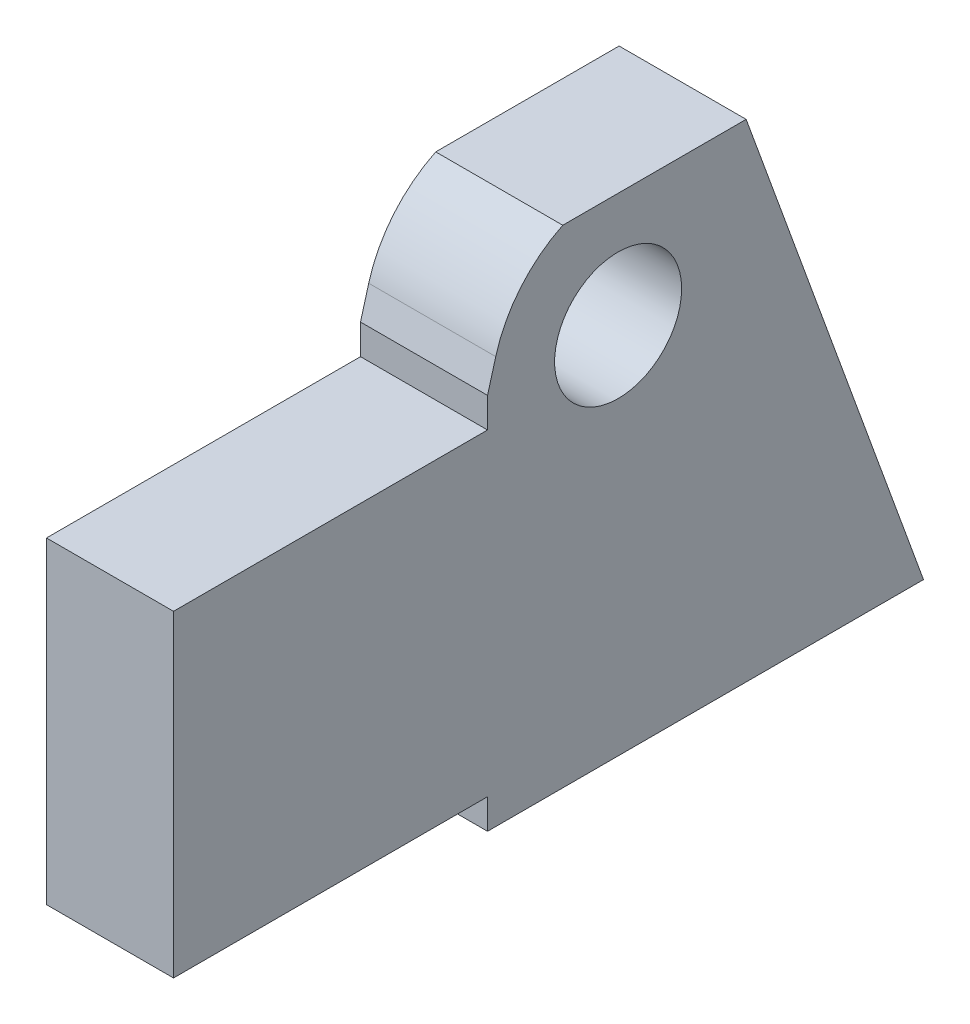
ISO-10303-21;
HEADER;
FILE_DESCRIPTION(('STEP AP214'),'2;1');
FILE_NAME('part.step','',(''),(''),'','','');
FILE_SCHEMA(('AUTOMOTIVE_DESIGN { 1 0 10303 214 1 1 1 1 }'));
ENDSEC;
DATA;
#1=APPLICATION_CONTEXT('core data for automotive mechanical design processes');
#2=APPLICATION_PROTOCOL_DEFINITION('international standard','automotive_design',2000,#1);
#3=PRODUCT_CONTEXT('',#1,'mechanical');
#4=PRODUCT('Part','Part','',(#3));
#5=PRODUCT_RELATED_PRODUCT_CATEGORY('part','',(#4));
#6=PRODUCT_DEFINITION_FORMATION('','',#4);
#7=PRODUCT_DEFINITION_CONTEXT('part definition',#1,'design');
#8=PRODUCT_DEFINITION('design','',#6,#7);
#9=PRODUCT_DEFINITION_SHAPE('','',#8);
#10=(LENGTH_UNIT() NAMED_UNIT(*) SI_UNIT(.MILLI.,.METRE.));
#11=(NAMED_UNIT(*) PLANE_ANGLE_UNIT() SI_UNIT($,.RADIAN.));
#12=(NAMED_UNIT(*) SI_UNIT($,.STERADIAN.) SOLID_ANGLE_UNIT());
#13=UNCERTAINTY_MEASURE_WITH_UNIT(LENGTH_MEASURE(1.E-05),#10,'distance_accuracy_value','');
#14=(GEOMETRIC_REPRESENTATION_CONTEXT(3) GLOBAL_UNCERTAINTY_ASSIGNED_CONTEXT((#13)) GLOBAL_UNIT_ASSIGNED_CONTEXT((#10,
#11,#12)) REPRESENTATION_CONTEXT('',''));
#15=CARTESIAN_POINT('',(0.,0.,0.));
#16=DIRECTION('',(0.,0.,1.));
#17=DIRECTION('',(1.,0.,0.));
#18=AXIS2_PLACEMENT_3D('',#15,#16,#17);
#19=CARTESIAN_POINT('',(6.35,-2.99720000000001,-31.3944));
#20=DIRECTION('',(0.,1.,0.));
#21=DIRECTION('',(0.,0.,1.));
#22=AXIS2_PLACEMENT_3D('',#19,#20,#21);
#23=PLANE('',#22);
#24=DIRECTION('',(0.,0.,-1.));
#25=VECTOR('',#24,1.);
#26=CARTESIAN_POINT('',(-6.35,-2.99720000000001,-31.3944));
#27=LINE('',#26,#25);
#28=CARTESIAN_POINT('',(-6.35,-2.99720000000001,-31.3944));
#29=VERTEX_POINT('',#28);
#30=CARTESIAN_POINT('',(-6.35,-2.9972,-74.9808));
#31=VERTEX_POINT('',#30);
#32=EDGE_CURVE('E140',#29,#31,#27,.T.);
#33=ORIENTED_EDGE('',*,*,#32,.T.);
#34=DIRECTION('',(-1.,0.,0.));
#35=VECTOR('',#34,1.);
#36=CARTESIAN_POINT('',(6.35,-2.9972,-74.9808));
#37=LINE('',#36,#35);
#38=CARTESIAN_POINT('',(6.35,-2.9972,-74.9808));
#39=VERTEX_POINT('',#38);
#40=EDGE_CURVE('E11',#39,#31,#37,.T.);
#41=ORIENTED_EDGE('',*,*,#40,.F.);
#42=DIRECTION('',(0.,0.,-1.));
#43=VECTOR('',#42,1.);
#44=CARTESIAN_POINT('',(6.35,-2.99720000000001,-31.3944));
#45=LINE('',#44,#43);
#46=CARTESIAN_POINT('',(6.35,-2.99720000000001,-31.3944));
#47=VERTEX_POINT('',#46);
#48=EDGE_CURVE('E161',#47,#39,#45,.T.);
#49=ORIENTED_EDGE('',*,*,#48,.F.);
#50=DIRECTION('',(-1.,0.,0.));
#51=VECTOR('',#50,1.);
#52=CARTESIAN_POINT('',(6.35,-2.99720000000001,-31.3944));
#53=LINE('',#52,#51);
#54=EDGE_CURVE('E136',#47,#29,#53,.T.);
#55=ORIENTED_EDGE('',*,*,#54,.T.);
#56=EDGE_LOOP('',(#33,#41,#49,#55));
#57=FACE_BOUND('',#56,.T.);
#58=ADVANCED_FACE('F39',(#57),#23,.F.);
#59=CARTESIAN_POINT('',(6.35,34.7472,-61.2429618897629));
#60=DIRECTION('',(0.,-0.342020143325666,0.939692620785909));
#61=DIRECTION('',(0.,-0.939692620785909,-0.342020143325666));
#62=AXIS2_PLACEMENT_3D('',#59,#60,#61);
#63=PLANE('',#62);
#64=DIRECTION('',(0.,0.939692620785909,0.342020143325666));
#65=VECTOR('',#64,1.);
#66=CARTESIAN_POINT('',(-6.35,34.7472,-61.2429618897629));
#67=LINE('',#66,#65);
#68=CARTESIAN_POINT('',(-6.35,45.72,-57.2491893032067));
#69=VERTEX_POINT('',#68);
#70=EDGE_CURVE('E144',#31,#69,#67,.T.);
#71=ORIENTED_EDGE('',*,*,#70,.T.);
#72=DIRECTION('',(1.,0.,0.));
#73=VECTOR('',#72,1.);
#74=CARTESIAN_POINT('',(-6.35,45.72,-57.2491893032067));
#75=LINE('',#74,#73);
#76=CARTESIAN_POINT('',(6.35,45.72,-57.2491893032067));
#77=VERTEX_POINT('',#76);
#78=EDGE_CURVE('E192',#69,#77,#75,.T.);
#79=ORIENTED_EDGE('',*,*,#78,.T.);
#80=DIRECTION('',(0.,0.939692620785909,0.342020143325666));
#81=VECTOR('',#80,1.);
#82=CARTESIAN_POINT('',(6.35,34.7472,-61.2429618897629));
#83=LINE('',#82,#81);
#84=EDGE_CURVE('E97',#39,#77,#83,.T.);
#85=ORIENTED_EDGE('',*,*,#84,.F.);
#86=ORIENTED_EDGE('',*,*,#40,.T.);
#87=EDGE_LOOP('',(#71,#79,#85,#86));
#88=FACE_BOUND('',#87,.T.);
#89=ADVANCED_FACE('F245',(#88),#63,.F.);
#90=CARTESIAN_POINT('',(6.35,31.75,-31.3944));
#91=DIRECTION('',(0.,0.,-1.));
#92=DIRECTION('',(-1.,0.,0.));
#93=AXIS2_PLACEMENT_3D('',#90,#91,#92);
#94=PLANE('',#93);
#95=DIRECTION('',(0.,-1.,0.));
#96=VECTOR('',#95,1.);
#97=CARTESIAN_POINT('',(-6.35,31.75,-31.3944));
#98=LINE('',#97,#96);
#99=CARTESIAN_POINT('',(-6.35,34.7472,-31.3944));
#100=VERTEX_POINT('',#99);
#101=CARTESIAN_POINT('',(-6.35,31.75,-31.3944));
#102=VERTEX_POINT('',#101);
#103=EDGE_CURVE('E149',#100,#102,#98,.T.);
#104=ORIENTED_EDGE('',*,*,#103,.T.);
#105=DIRECTION('',(-1.,0.,0.));
#106=VECTOR('',#105,1.);
#107=CARTESIAN_POINT('',(6.35,31.75,-31.3944));
#108=LINE('',#107,#106);
#109=CARTESIAN_POINT('',(6.35,31.75,-31.3944));
#110=VERTEX_POINT('',#109);
#111=EDGE_CURVE('E168',#110,#102,#108,.T.);
#112=ORIENTED_EDGE('',*,*,#111,.F.);
#113=DIRECTION('',(0.,-1.,0.));
#114=VECTOR('',#113,1.);
#115=CARTESIAN_POINT('',(6.35,31.75,-31.3944));
#116=LINE('',#115,#114);
#117=CARTESIAN_POINT('',(6.35,34.7472,-31.3944));
#118=VERTEX_POINT('',#117);
#119=EDGE_CURVE('E177',#118,#110,#116,.T.);
#120=ORIENTED_EDGE('',*,*,#119,.F.);
#121=DIRECTION('',(-1.,0.,0.));
#122=VECTOR('',#121,1.);
#123=CARTESIAN_POINT('',(6.35,34.7472,-31.3944));
#124=LINE('',#123,#122);
#125=EDGE_CURVE('E48',#118,#100,#124,.T.);
#126=ORIENTED_EDGE('',*,*,#125,.T.);
#127=EDGE_LOOP('',(#104,#112,#120,#126));
#128=FACE_BOUND('',#127,.T.);
#129=ADVANCED_FACE('F175',(#128),#94,.F.);
#130=CARTESIAN_POINT('',(6.35,31.75,0.));
#131=DIRECTION('',(0.,-1.,0.));
#132=DIRECTION('',(0.,0.,-1.));
#133=AXIS2_PLACEMENT_3D('',#130,#131,#132);
#134=PLANE('',#133);
#135=DIRECTION('',(0.,0.,1.));
#136=VECTOR('',#135,1.);
#137=CARTESIAN_POINT('',(-6.35,31.75,0.));
#138=LINE('',#137,#136);
#139=CARTESIAN_POINT('',(-6.35,31.75,0.));
#140=VERTEX_POINT('',#139);
#141=EDGE_CURVE('E152',#102,#140,#138,.T.);
#142=ORIENTED_EDGE('',*,*,#141,.T.);
#143=DIRECTION('',(-1.,0.,0.));
#144=VECTOR('',#143,1.);
#145=CARTESIAN_POINT('',(6.35,31.75,0.));
#146=LINE('',#145,#144);
#147=CARTESIAN_POINT('',(6.35,31.75,0.));
#148=VERTEX_POINT('',#147);
#149=EDGE_CURVE('E129',#148,#140,#146,.T.);
#150=ORIENTED_EDGE('',*,*,#149,.F.);
#151=DIRECTION('',(0.,0.,1.));
#152=VECTOR('',#151,1.);
#153=CARTESIAN_POINT('',(6.35,31.75,0.));
#154=LINE('',#153,#152);
#155=EDGE_CURVE('E118',#110,#148,#154,.T.);
#156=ORIENTED_EDGE('',*,*,#155,.F.);
#157=ORIENTED_EDGE('',*,*,#111,.T.);
#158=EDGE_LOOP('',(#142,#150,#156,#157));
#159=FACE_BOUND('',#158,.T.);
#160=ADVANCED_FACE('F227',(#159),#134,.F.);
#161=CARTESIAN_POINT('',(6.35,31.75,0.));
#162=DIRECTION('',(0.,0.,-1.));
#163=DIRECTION('',(0.,1.,0.));
#164=AXIS2_PLACEMENT_3D('',#161,#162,#163);
#165=PLANE('',#164);
#166=DIRECTION('',(0.,-1.,0.));
#167=VECTOR('',#166,1.);
#168=CARTESIAN_POINT('',(-6.35,31.75,0.));
#169=LINE('',#168,#167);
#170=CARTESIAN_POINT('',(-6.35,0.,0.));
#171=VERTEX_POINT('',#170);
#172=EDGE_CURVE('E127',#140,#171,#169,.T.);
#173=ORIENTED_EDGE('',*,*,#172,.T.);
#174=DIRECTION('',(-1.,0.,0.));
#175=VECTOR('',#174,1.);
#176=CARTESIAN_POINT('',(6.35,0.,0.));
#177=LINE('',#176,#175);
#178=CARTESIAN_POINT('',(6.35,0.,0.));
#179=VERTEX_POINT('',#178);
#180=EDGE_CURVE('E124',#179,#171,#177,.T.);
#181=ORIENTED_EDGE('',*,*,#180,.F.);
#182=DIRECTION('',(0.,-1.,0.));
#183=VECTOR('',#182,1.);
#184=CARTESIAN_POINT('',(6.35,31.75,0.));
#185=LINE('',#184,#183);
#186=EDGE_CURVE('E111',#148,#179,#185,.T.);
#187=ORIENTED_EDGE('',*,*,#186,.F.);
#188=ORIENTED_EDGE('',*,*,#149,.T.);
#189=EDGE_LOOP('',(#173,#181,#187,#188));
#190=FACE_BOUND('',#189,.T.);
#191=ADVANCED_FACE('F125',(#190),#165,.F.);
#192=CARTESIAN_POINT('',(6.35,0.,-31.3944));
#193=DIRECTION('',(0.,1.,0.));
#194=DIRECTION('',(0.,0.,1.));
#195=AXIS2_PLACEMENT_3D('',#192,#193,#194);
#196=PLANE('',#195);
#197=DIRECTION('',(0.,0.,-1.));
#198=VECTOR('',#197,1.);
#199=CARTESIAN_POINT('',(-6.35,0.,-31.3944));
#200=LINE('',#199,#198);
#201=CARTESIAN_POINT('',(-6.35,0.,-31.3944));
#202=VERTEX_POINT('',#201);
#203=EDGE_CURVE('E83',#171,#202,#200,.T.);
#204=ORIENTED_EDGE('',*,*,#203,.T.);
#205=DIRECTION('',(-1.,0.,0.));
#206=VECTOR('',#205,1.);
#207=CARTESIAN_POINT('',(6.35,0.,-31.3944));
#208=LINE('',#207,#206);
#209=CARTESIAN_POINT('',(6.35,0.,-31.3944));
#210=VERTEX_POINT('',#209);
#211=EDGE_CURVE('E130',#210,#202,#208,.T.);
#212=ORIENTED_EDGE('',*,*,#211,.F.);
#213=DIRECTION('',(0.,0.,-1.));
#214=VECTOR('',#213,1.);
#215=CARTESIAN_POINT('',(6.35,0.,-31.3944));
#216=LINE('',#215,#214);
#217=EDGE_CURVE('E116',#179,#210,#216,.T.);
#218=ORIENTED_EDGE('',*,*,#217,.F.);
#219=ORIENTED_EDGE('',*,*,#180,.T.);
#220=EDGE_LOOP('',(#204,#212,#218,#219));
#221=FACE_BOUND('',#220,.T.);
#222=ADVANCED_FACE('F132',(#221),#196,.F.);
#223=CARTESIAN_POINT('',(6.35,0.,-31.3944));
#224=DIRECTION('',(0.,0.,-1.));
#225=DIRECTION('',(-1.,0.,0.));
#226=AXIS2_PLACEMENT_3D('',#223,#224,#225);
#227=PLANE('',#226);
#228=DIRECTION('',(0.,-1.,0.));
#229=VECTOR('',#228,1.);
#230=CARTESIAN_POINT('',(-6.35,0.,-31.3944));
#231=LINE('',#230,#229);
#232=EDGE_CURVE('E89',#202,#29,#231,.T.);
#233=ORIENTED_EDGE('',*,*,#232,.T.);
#234=ORIENTED_EDGE('',*,*,#54,.F.);
#235=DIRECTION('',(0.,-1.,0.));
#236=VECTOR('',#235,1.);
#237=CARTESIAN_POINT('',(6.35,0.,-31.3944));
#238=LINE('',#237,#236);
#239=EDGE_CURVE('E56',#210,#47,#238,.T.);
#240=ORIENTED_EDGE('',*,*,#239,.F.);
#241=ORIENTED_EDGE('',*,*,#211,.T.);
#242=EDGE_LOOP('',(#233,#234,#240,#241));
#243=FACE_BOUND('',#242,.T.);
#244=ADVANCED_FACE('F233',(#243),#227,.F.);
#245=CARTESIAN_POINT('',(6.35,0.,0.));
#246=DIRECTION('',(1.,0.,0.));
#247=DIRECTION('',(0.,0.,-1.));
#248=AXIS2_PLACEMENT_3D('',#245,#246,#247);
#249=PLANE('',#248);
#250=CARTESIAN_POINT('',(6.35,34.29,-44.45));
#251=DIRECTION('',(1.,0.,0.));
#252=DIRECTION('',(0.,0.,-1.));
#253=AXIS2_PLACEMENT_3D('',#250,#251,#252);
#254=CIRCLE('',#253,6.35);
#255=CARTESIAN_POINT('',(6.35,34.29,-50.8));
#256=VERTEX_POINT('',#255);
#257=EDGE_CURVE('E344',#256,#256,#254,.T.);
#258=ORIENTED_EDGE('',*,*,#257,.F.);
#259=EDGE_LOOP('',(#258));
#260=FACE_BOUND('',#259,.T.);
#261=DIRECTION('',(0.,-0.963371460276273,0.268170523222));
#262=VECTOR('',#261,1.);
#263=CARTESIAN_POINT('',(6.35,34.7472,-31.3944));
#264=LINE('',#263,#262);
#265=CARTESIAN_POINT('',(6.35,37.6957656449194,-32.2151824544913));
#266=VERTEX_POINT('',#265);
#267=EDGE_CURVE('E212',#266,#118,#264,.T.);
#268=ORIENTED_EDGE('',*,*,#267,.T.);
#269=ORIENTED_EDGE('',*,*,#119,.T.);
#270=ORIENTED_EDGE('',*,*,#155,.T.);
#271=ORIENTED_EDGE('',*,*,#186,.T.);
#272=ORIENTED_EDGE('',*,*,#217,.T.);
#273=ORIENTED_EDGE('',*,*,#239,.T.);
#274=ORIENTED_EDGE('',*,*,#48,.T.);
#275=ORIENTED_EDGE('',*,*,#84,.T.);
#276=DIRECTION('',(0.,0.,1.));
#277=VECTOR('',#276,1.);
#278=CARTESIAN_POINT('',(6.35,45.72,-57.2491893032067));
#279=LINE('',#278,#277);
#280=CARTESIAN_POINT('',(6.35,45.72,-38.9141983417033));
#281=VERTEX_POINT('',#280);
#282=EDGE_CURVE('E203',#77,#281,#279,.T.);
#283=ORIENTED_EDGE('',*,*,#282,.T.);
#284=CARTESIAN_POINT('',(6.35,34.29,-44.45));
#285=DIRECTION('',(1.,0.,0.));
#286=DIRECTION('',(0.,0.,-1.));
#287=AXIS2_PLACEMENT_3D('',#284,#285,#286);
#288=CIRCLE('',#287,12.7);
#289=EDGE_CURVE('E207',#281,#266,#288,.T.);
#290=ORIENTED_EDGE('',*,*,#289,.T.);
#291=EDGE_LOOP('',(#268,#269,#270,#271,#272,#273,#274,#275,#283,#290));
#292=FACE_BOUND('',#291,.T.);
#293=ADVANCED_FACE('F114',(#260,#292),#249,.T.);
#294=CARTESIAN_POINT('',(-6.35,0.,0.));
#295=DIRECTION('',(1.,0.,0.));
#296=DIRECTION('',(0.,0.,-1.));
#297=AXIS2_PLACEMENT_3D('',#294,#295,#296);
#298=PLANE('',#297);
#299=CARTESIAN_POINT('',(-6.35,34.29,-44.45));
#300=DIRECTION('',(1.,0.,0.));
#301=DIRECTION('',(0.,0.,-1.));
#302=AXIS2_PLACEMENT_3D('',#299,#300,#301);
#303=CIRCLE('',#302,6.35);
#304=CARTESIAN_POINT('',(-6.35,34.29,-50.8));
#305=VERTEX_POINT('',#304);
#306=EDGE_CURVE('E208',#305,#305,#303,.T.);
#307=ORIENTED_EDGE('',*,*,#306,.T.);
#308=EDGE_LOOP('',(#307));
#309=FACE_BOUND('',#308,.T.);
#310=ORIENTED_EDGE('',*,*,#103,.F.);
#311=DIRECTION('',(0.,-0.963371460276273,0.268170523222));
#312=VECTOR('',#311,1.);
#313=CARTESIAN_POINT('',(-6.35,34.7472,-31.3944));
#314=LINE('',#313,#312);
#315=CARTESIAN_POINT('',(-6.35,37.6957656449194,-32.2151824544913));
#316=VERTEX_POINT('',#315);
#317=EDGE_CURVE('E186',#316,#100,#314,.T.);
#318=ORIENTED_EDGE('',*,*,#317,.F.);
#319=CARTESIAN_POINT('',(-6.35,34.29,-44.45));
#320=DIRECTION('',(1.,0.,0.));
#321=DIRECTION('',(0.,0.,-1.));
#322=AXIS2_PLACEMENT_3D('',#319,#320,#321);
#323=CIRCLE('',#322,12.7);
#324=CARTESIAN_POINT('',(-6.35,45.72,-38.9141983417033));
#325=VERTEX_POINT('',#324);
#326=EDGE_CURVE('E193',#325,#316,#323,.T.);
#327=ORIENTED_EDGE('',*,*,#326,.F.);
#328=DIRECTION('',(0.,0.,1.));
#329=VECTOR('',#328,1.);
#330=CARTESIAN_POINT('',(-6.35,45.72,-57.2491893032067));
#331=LINE('',#330,#329);
#332=EDGE_CURVE('E199',#69,#325,#331,.T.);
#333=ORIENTED_EDGE('',*,*,#332,.F.);
#334=ORIENTED_EDGE('',*,*,#70,.F.);
#335=ORIENTED_EDGE('',*,*,#32,.F.);
#336=ORIENTED_EDGE('',*,*,#232,.F.);
#337=ORIENTED_EDGE('',*,*,#203,.F.);
#338=ORIENTED_EDGE('',*,*,#172,.F.);
#339=ORIENTED_EDGE('',*,*,#141,.F.);
#340=EDGE_LOOP('',(#310,#318,#327,#333,#334,#335,#336,#337,#338,#339));
#341=FACE_BOUND('',#340,.T.);
#342=ADVANCED_FACE('F184',(#309,#341),#298,.F.);
#343=CARTESIAN_POINT('',(-6.35,34.7472,-31.3944));
#344=DIRECTION('',(0.,0.268170523222,0.963371460276273));
#345=DIRECTION('',(0.,-0.963371460276273,0.268170523222));
#346=AXIS2_PLACEMENT_3D('',#343,#344,#345);
#347=PLANE('',#346);
#348=ORIENTED_EDGE('',*,*,#267,.F.);
#349=DIRECTION('',(1.,0.,0.));
#350=VECTOR('',#349,1.);
#351=CARTESIAN_POINT('',(-6.35,37.6957656449194,-32.2151824544913));
#352=LINE('',#351,#350);
#353=EDGE_CURVE('E145',#316,#266,#352,.T.);
#354=ORIENTED_EDGE('',*,*,#353,.F.);
#355=ORIENTED_EDGE('',*,*,#317,.T.);
#356=ORIENTED_EDGE('',*,*,#125,.F.);
#357=EDGE_LOOP('',(#348,#354,#355,#356));
#358=FACE_BOUND('',#357,.T.);
#359=ADVANCED_FACE('F189',(#358),#347,.T.);
#360=CARTESIAN_POINT('',(-6.35,34.29,-44.45));
#361=DIRECTION('',(1.,0.,0.));
#362=DIRECTION('',(0.,0.,-1.));
#363=AXIS2_PLACEMENT_3D('',#360,#361,#362);
#364=CYLINDRICAL_SURFACE('',#363,12.7);
#365=ORIENTED_EDGE('',*,*,#289,.F.);
#366=DIRECTION('',(1.,0.,0.));
#367=VECTOR('',#366,1.);
#368=CARTESIAN_POINT('',(-6.35,45.72,-38.9141983417033));
#369=LINE('',#368,#367);
#370=EDGE_CURVE('E197',#325,#281,#369,.T.);
#371=ORIENTED_EDGE('',*,*,#370,.F.);
#372=ORIENTED_EDGE('',*,*,#326,.T.);
#373=ORIENTED_EDGE('',*,*,#353,.T.);
#374=EDGE_LOOP('',(#365,#371,#372,#373));
#375=FACE_BOUND('',#374,.T.);
#376=ADVANCED_FACE('F293',(#375),#364,.T.);
#377=CARTESIAN_POINT('',(-6.35,45.72,-57.2491893032067));
#378=DIRECTION('',(0.,1.,0.));
#379=DIRECTION('',(0.,0.,1.));
#380=AXIS2_PLACEMENT_3D('',#377,#378,#379);
#381=PLANE('',#380);
#382=ORIENTED_EDGE('',*,*,#282,.F.);
#383=ORIENTED_EDGE('',*,*,#78,.F.);
#384=ORIENTED_EDGE('',*,*,#332,.T.);
#385=ORIENTED_EDGE('',*,*,#370,.T.);
#386=EDGE_LOOP('',(#382,#383,#384,#385));
#387=FACE_BOUND('',#386,.T.);
#388=ADVANCED_FACE('F304',(#387),#381,.T.);
#389=CARTESIAN_POINT('',(-6.35,34.29,-44.45));
#390=DIRECTION('',(1.,0.,0.));
#391=DIRECTION('',(0.,0.,-1.));
#392=AXIS2_PLACEMENT_3D('',#389,#390,#391);
#393=CYLINDRICAL_SURFACE('',#392,6.35);
#394=ORIENTED_EDGE('',*,*,#306,.F.);
#395=EDGE_LOOP('',(#394));
#396=FACE_BOUND('',#395,.T.);
#397=ORIENTED_EDGE('',*,*,#257,.T.);
#398=EDGE_LOOP('',(#397));
#399=FACE_BOUND('',#398,.T.);
#400=ADVANCED_FACE('F314',(#396,#399),#393,.F.);
#401=CLOSED_SHELL('',(#58,#89,#129,#160,#191,#222,#244,#293,#342,#359,#376,#388,#400));
#402=MANIFOLD_SOLID_BREP('B2',#401);
#403=ADVANCED_BREP_SHAPE_REPRESENTATION('',(#18,#402),#14);
#404=SHAPE_DEFINITION_REPRESENTATION(#9,#403);
ENDSEC;
END-ISO-10303-21;
